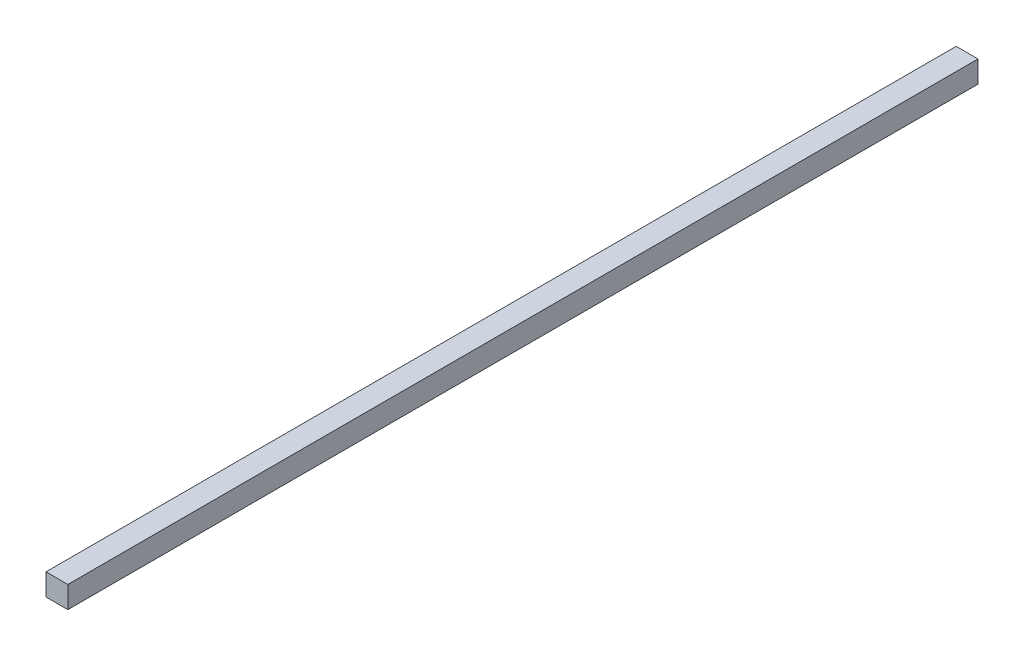
ISO-10303-21;
HEADER;
FILE_DESCRIPTION(('STEP AP214'),'2;1');
FILE_NAME('part.step','',(''),(''),'','','');
FILE_SCHEMA(('AUTOMOTIVE_DESIGN { 1 0 10303 214 1 1 1 1 }'));
ENDSEC;
DATA;
#1=APPLICATION_CONTEXT('core data for automotive mechanical design processes');
#2=APPLICATION_PROTOCOL_DEFINITION('international standard','automotive_design',2000,#1);
#3=PRODUCT_CONTEXT('',#1,'mechanical');
#4=PRODUCT('Part','Part','',(#3));
#5=PRODUCT_RELATED_PRODUCT_CATEGORY('part','',(#4));
#6=PRODUCT_DEFINITION_FORMATION('','',#4);
#7=PRODUCT_DEFINITION_CONTEXT('part definition',#1,'design');
#8=PRODUCT_DEFINITION('design','',#6,#7);
#9=PRODUCT_DEFINITION_SHAPE('','',#8);
#10=(LENGTH_UNIT() NAMED_UNIT(*) SI_UNIT(.MILLI.,.METRE.));
#11=(NAMED_UNIT(*) PLANE_ANGLE_UNIT() SI_UNIT($,.RADIAN.));
#12=(NAMED_UNIT(*) SI_UNIT($,.STERADIAN.) SOLID_ANGLE_UNIT());
#13=UNCERTAINTY_MEASURE_WITH_UNIT(LENGTH_MEASURE(1.E-05),#10,'distance_accuracy_value','');
#14=(GEOMETRIC_REPRESENTATION_CONTEXT(3) GLOBAL_UNCERTAINTY_ASSIGNED_CONTEXT((#13)) GLOBAL_UNIT_ASSIGNED_CONTEXT((#10,
#11,#12)) REPRESENTATION_CONTEXT('',''));
#15=CARTESIAN_POINT('',(0.,0.,0.));
#16=DIRECTION('',(0.,0.,1.));
#17=DIRECTION('',(1.,0.,0.));
#18=AXIS2_PLACEMENT_3D('',#15,#16,#17);
#19=CARTESIAN_POINT('',(0.,0.,-750.));
#20=DIRECTION('',(-1.,0.,0.));
#21=DIRECTION('',(0.,0.,1.));
#22=AXIS2_PLACEMENT_3D('',#19,#20,#21);
#23=PLANE('',#22);
#24=DIRECTION('',(0.,-1.,0.));
#25=VECTOR('',#24,1.);
#26=CARTESIAN_POINT('',(0.,0.,0.));
#27=LINE('',#26,#25);
#28=CARTESIAN_POINT('',(0.,18.,0.));
#29=VERTEX_POINT('',#28);
#30=CARTESIAN_POINT('',(0.,0.,0.));
#31=VERTEX_POINT('',#30);
#32=EDGE_CURVE('E95',#29,#31,#27,.T.);
#33=ORIENTED_EDGE('',*,*,#32,.F.);
#34=DIRECTION('',(0.,0.,1.));
#35=VECTOR('',#34,1.);
#36=CARTESIAN_POINT('',(0.,18.,-750.));
#37=LINE('',#36,#35);
#38=CARTESIAN_POINT('',(0.,18.,-750.));
#39=VERTEX_POINT('',#38);
#40=EDGE_CURVE('E11',#39,#29,#37,.T.);
#41=ORIENTED_EDGE('',*,*,#40,.F.);
#42=DIRECTION('',(0.,-1.,0.));
#43=VECTOR('',#42,1.);
#44=CARTESIAN_POINT('',(0.,0.,-750.));
#45=LINE('',#44,#43);
#46=CARTESIAN_POINT('',(0.,0.,-750.));
#47=VERTEX_POINT('',#46);
#48=EDGE_CURVE('E89',#39,#47,#45,.T.);
#49=ORIENTED_EDGE('',*,*,#48,.T.);
#50=DIRECTION('',(0.,0.,1.));
#51=VECTOR('',#50,1.);
#52=CARTESIAN_POINT('',(0.,0.,-750.));
#53=LINE('',#52,#51);
#54=EDGE_CURVE('E34',#47,#31,#53,.T.);
#55=ORIENTED_EDGE('',*,*,#54,.T.);
#56=EDGE_LOOP('',(#33,#41,#49,#55));
#57=FACE_BOUND('',#56,.T.);
#58=ADVANCED_FACE('F31',(#57),#23,.T.);
#59=CARTESIAN_POINT('',(0.,18.,-750.));
#60=DIRECTION('',(0.,1.,0.));
#61=DIRECTION('',(0.,0.,1.));
#62=AXIS2_PLACEMENT_3D('',#59,#60,#61);
#63=PLANE('',#62);
#64=DIRECTION('',(-1.,0.,0.));
#65=VECTOR('',#64,1.);
#66=CARTESIAN_POINT('',(0.,18.,0.));
#67=LINE('',#66,#65);
#68=CARTESIAN_POINT('',(18.,18.,0.));
#69=VERTEX_POINT('',#68);
#70=EDGE_CURVE('E91',#69,#29,#67,.T.);
#71=ORIENTED_EDGE('',*,*,#70,.F.);
#72=DIRECTION('',(0.,0.,1.));
#73=VECTOR('',#72,1.);
#74=CARTESIAN_POINT('',(18.,18.,-750.));
#75=LINE('',#74,#73);
#76=CARTESIAN_POINT('',(18.,18.,-750.));
#77=VERTEX_POINT('',#76);
#78=EDGE_CURVE('E40',#77,#69,#75,.T.);
#79=ORIENTED_EDGE('',*,*,#78,.F.);
#80=DIRECTION('',(-1.,0.,0.));
#81=VECTOR('',#80,1.);
#82=CARTESIAN_POINT('',(0.,18.,-750.));
#83=LINE('',#82,#81);
#84=EDGE_CURVE('E86',#77,#39,#83,.T.);
#85=ORIENTED_EDGE('',*,*,#84,.T.);
#86=ORIENTED_EDGE('',*,*,#40,.T.);
#87=EDGE_LOOP('',(#71,#79,#85,#86));
#88=FACE_BOUND('',#87,.T.);
#89=ADVANCED_FACE('F105',(#88),#63,.T.);
#90=CARTESIAN_POINT('',(18.,0.,-750.));
#91=DIRECTION('',(1.,0.,0.));
#92=DIRECTION('',(0.,0.,-1.));
#93=AXIS2_PLACEMENT_3D('',#90,#91,#92);
#94=PLANE('',#93);
#95=DIRECTION('',(0.,1.,0.));
#96=VECTOR('',#95,1.);
#97=CARTESIAN_POINT('',(18.,0.,0.));
#98=LINE('',#97,#96);
#99=CARTESIAN_POINT('',(18.,0.,0.));
#100=VERTEX_POINT('',#99);
#101=EDGE_CURVE('E81',#100,#69,#98,.T.);
#102=ORIENTED_EDGE('',*,*,#101,.F.);
#103=DIRECTION('',(0.,0.,1.));
#104=VECTOR('',#103,1.);
#105=CARTESIAN_POINT('',(18.,0.,-750.));
#106=LINE('',#105,#104);
#107=CARTESIAN_POINT('',(18.,0.,-750.));
#108=VERTEX_POINT('',#107);
#109=EDGE_CURVE('E76',#108,#100,#106,.T.);
#110=ORIENTED_EDGE('',*,*,#109,.F.);
#111=DIRECTION('',(0.,1.,0.));
#112=VECTOR('',#111,1.);
#113=CARTESIAN_POINT('',(18.,0.,-750.));
#114=LINE('',#113,#112);
#115=EDGE_CURVE('E79',#108,#77,#114,.T.);
#116=ORIENTED_EDGE('',*,*,#115,.T.);
#117=ORIENTED_EDGE('',*,*,#78,.T.);
#118=EDGE_LOOP('',(#102,#110,#116,#117));
#119=FACE_BOUND('',#118,.T.);
#120=ADVANCED_FACE('F78',(#119),#94,.T.);
#121=CARTESIAN_POINT('',(0.,0.,-750.));
#122=DIRECTION('',(0.,-1.,0.));
#123=DIRECTION('',(0.,0.,-1.));
#124=AXIS2_PLACEMENT_3D('',#121,#122,#123);
#125=PLANE('',#124);
#126=DIRECTION('',(1.,0.,0.));
#127=VECTOR('',#126,1.);
#128=CARTESIAN_POINT('',(0.,0.,0.));
#129=LINE('',#128,#127);
#130=EDGE_CURVE('E98',#31,#100,#129,.T.);
#131=ORIENTED_EDGE('',*,*,#130,.F.);
#132=ORIENTED_EDGE('',*,*,#54,.F.);
#133=DIRECTION('',(1.,0.,0.));
#134=VECTOR('',#133,1.);
#135=CARTESIAN_POINT('',(0.,0.,-750.));
#136=LINE('',#135,#134);
#137=EDGE_CURVE('E85',#47,#108,#136,.T.);
#138=ORIENTED_EDGE('',*,*,#137,.T.);
#139=ORIENTED_EDGE('',*,*,#109,.T.);
#140=EDGE_LOOP('',(#131,#132,#138,#139));
#141=FACE_BOUND('',#140,.T.);
#142=ADVANCED_FACE('F88',(#141),#125,.T.);
#143=CARTESIAN_POINT('',(0.,18.,-750.));
#144=DIRECTION('',(0.,0.,-1.));
#145=DIRECTION('',(-1.,0.,0.));
#146=AXIS2_PLACEMENT_3D('',#143,#144,#145);
#147=PLANE('',#146);
#148=ORIENTED_EDGE('',*,*,#48,.F.);
#149=ORIENTED_EDGE('',*,*,#84,.F.);
#150=ORIENTED_EDGE('',*,*,#115,.F.);
#151=ORIENTED_EDGE('',*,*,#137,.F.);
#152=EDGE_LOOP('',(#148,#149,#150,#151));
#153=FACE_BOUND('',#152,.T.);
#154=ADVANCED_FACE('F84',(#153),#147,.T.);
#155=CARTESIAN_POINT('',(0.,18.,0.));
#156=DIRECTION('',(0.,0.,-1.));
#157=DIRECTION('',(-1.,0.,0.));
#158=AXIS2_PLACEMENT_3D('',#155,#156,#157);
#159=PLANE('',#158);
#160=ORIENTED_EDGE('',*,*,#32,.T.);
#161=ORIENTED_EDGE('',*,*,#130,.T.);
#162=ORIENTED_EDGE('',*,*,#101,.T.);
#163=ORIENTED_EDGE('',*,*,#70,.T.);
#164=EDGE_LOOP('',(#160,#161,#162,#163));
#165=FACE_BOUND('',#164,.T.);
#166=ADVANCED_FACE('F104',(#165),#159,.F.);
#167=CLOSED_SHELL('',(#58,#89,#120,#142,#154,#166));
#168=MANIFOLD_SOLID_BREP('B2',#167);
#169=ADVANCED_BREP_SHAPE_REPRESENTATION('',(#18,#168),#14);
#170=SHAPE_DEFINITION_REPRESENTATION(#9,#169);
ENDSEC;
END-ISO-10303-21;
